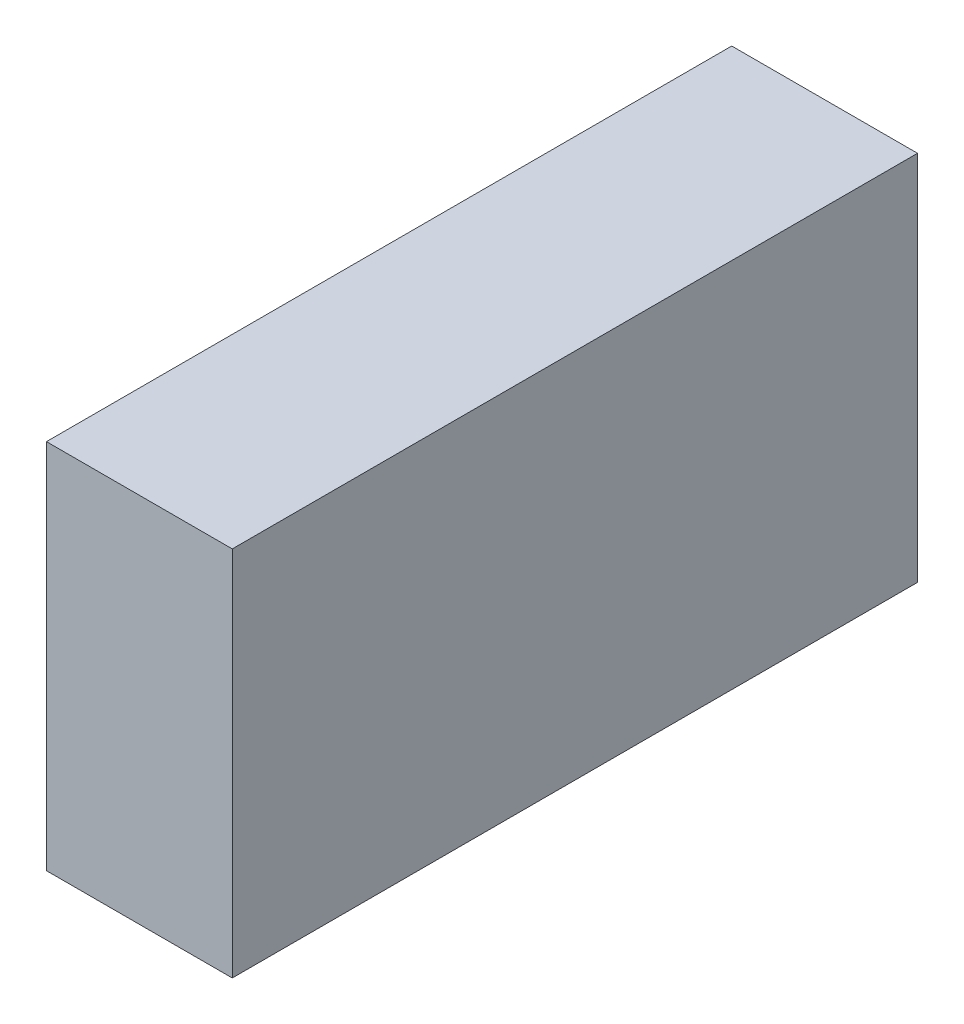
ISO-10303-21;
HEADER;
FILE_DESCRIPTION(('STEP AP214'),'2;1');
FILE_NAME('part.step','',(''),(''),'','','');
FILE_SCHEMA(('AUTOMOTIVE_DESIGN { 1 0 10303 214 1 1 1 1 }'));
ENDSEC;
DATA;
#1=APPLICATION_CONTEXT('core data for automotive mechanical design processes');
#2=APPLICATION_PROTOCOL_DEFINITION('international standard','automotive_design',2000,#1);
#3=PRODUCT_CONTEXT('',#1,'mechanical');
#4=PRODUCT('Part','Part','',(#3));
#5=PRODUCT_RELATED_PRODUCT_CATEGORY('part','',(#4));
#6=PRODUCT_DEFINITION_FORMATION('','',#4);
#7=PRODUCT_DEFINITION_CONTEXT('part definition',#1,'design');
#8=PRODUCT_DEFINITION('design','',#6,#7);
#9=PRODUCT_DEFINITION_SHAPE('','',#8);
#10=(LENGTH_UNIT() NAMED_UNIT(*) SI_UNIT(.MILLI.,.METRE.));
#11=(NAMED_UNIT(*) PLANE_ANGLE_UNIT() SI_UNIT($,.RADIAN.));
#12=(NAMED_UNIT(*) SI_UNIT($,.STERADIAN.) SOLID_ANGLE_UNIT());
#13=UNCERTAINTY_MEASURE_WITH_UNIT(LENGTH_MEASURE(1.E-05),#10,'distance_accuracy_value','');
#14=(GEOMETRIC_REPRESENTATION_CONTEXT(3) GLOBAL_UNCERTAINTY_ASSIGNED_CONTEXT((#13)) GLOBAL_UNIT_ASSIGNED_CONTEXT((#10,
#11,#12)) REPRESENTATION_CONTEXT('',''));
#15=CARTESIAN_POINT('',(0.,0.,0.));
#16=DIRECTION('',(0.,0.,1.));
#17=DIRECTION('',(1.,0.,0.));
#18=AXIS2_PLACEMENT_3D('',#15,#16,#17);
#19=CARTESIAN_POINT('',(0.,25.,0.));
#20=DIRECTION('',(1.,0.,0.));
#21=DIRECTION('',(0.,0.,-1.));
#22=AXIS2_PLACEMENT_3D('',#19,#20,#21);
#23=PLANE('',#22);
#24=DIRECTION('',(0.,0.,-1.));
#25=VECTOR('',#24,1.);
#26=CARTESIAN_POINT('',(0.,10.,0.));
#27=LINE('',#26,#25);
#28=CARTESIAN_POINT('',(0.,10.,0.));
#29=VERTEX_POINT('',#28);
#30=CARTESIAN_POINT('',(0.,10.,-27.66));
#31=VERTEX_POINT('',#30);
#32=EDGE_CURVE('E57',#29,#31,#27,.T.);
#33=ORIENTED_EDGE('',*,*,#32,.F.);
#34=DIRECTION('',(0.,-1.,0.));
#35=VECTOR('',#34,1.);
#36=CARTESIAN_POINT('',(0.,25.,0.));
#37=LINE('',#36,#35);
#38=CARTESIAN_POINT('',(0.,25.,0.));
#39=VERTEX_POINT('',#38);
#40=EDGE_CURVE('E11',#39,#29,#37,.T.);
#41=ORIENTED_EDGE('',*,*,#40,.F.);
#42=DIRECTION('',(0.,0.,1.));
#43=VECTOR('',#42,1.);
#44=CARTESIAN_POINT('',(0.,25.,0.));
#45=LINE('',#44,#43);
#46=CARTESIAN_POINT('',(0.,25.,-27.66));
#47=VERTEX_POINT('',#46);
#48=EDGE_CURVE('E109',#47,#39,#45,.T.);
#49=ORIENTED_EDGE('',*,*,#48,.F.);
#50=DIRECTION('',(0.,-1.,0.));
#51=VECTOR('',#50,1.);
#52=CARTESIAN_POINT('',(0.,25.,-27.66));
#53=LINE('',#52,#51);
#54=EDGE_CURVE('E100',#47,#31,#53,.T.);
#55=ORIENTED_EDGE('',*,*,#54,.T.);
#56=EDGE_LOOP('',(#33,#41,#49,#55));
#57=FACE_BOUND('',#56,.T.);
#58=ADVANCED_FACE('F43',(#57),#23,.F.);
#59=CARTESIAN_POINT('',(0.,25.,0.));
#60=DIRECTION('',(0.,0.,-1.));
#61=DIRECTION('',(-1.,0.,0.));
#62=AXIS2_PLACEMENT_3D('',#59,#60,#61);
#63=PLANE('',#62);
#64=DIRECTION('',(-1.,0.,0.));
#65=VECTOR('',#64,1.);
#66=CARTESIAN_POINT('',(0.,10.,0.));
#67=LINE('',#66,#65);
#68=CARTESIAN_POINT('',(7.5,10.,0.));
#69=VERTEX_POINT('',#68);
#70=EDGE_CURVE('E97',#69,#29,#67,.T.);
#71=ORIENTED_EDGE('',*,*,#70,.F.);
#72=DIRECTION('',(0.,-1.,0.));
#73=VECTOR('',#72,1.);
#74=CARTESIAN_POINT('',(7.5,25.,0.));
#75=LINE('',#74,#73);
#76=CARTESIAN_POINT('',(7.5,25.,0.));
#77=VERTEX_POINT('',#76);
#78=EDGE_CURVE('E50',#77,#69,#75,.T.);
#79=ORIENTED_EDGE('',*,*,#78,.F.);
#80=DIRECTION('',(1.,0.,0.));
#81=VECTOR('',#80,1.);
#82=CARTESIAN_POINT('',(0.,25.,0.));
#83=LINE('',#82,#81);
#84=EDGE_CURVE('E107',#39,#77,#83,.T.);
#85=ORIENTED_EDGE('',*,*,#84,.F.);
#86=ORIENTED_EDGE('',*,*,#40,.T.);
#87=EDGE_LOOP('',(#71,#79,#85,#86));
#88=FACE_BOUND('',#87,.T.);
#89=ADVANCED_FACE('F116',(#88),#63,.F.);
#90=CARTESIAN_POINT('',(7.5,25.,0.));
#91=DIRECTION('',(-1.,0.,0.));
#92=DIRECTION('',(0.,0.,1.));
#93=AXIS2_PLACEMENT_3D('',#90,#91,#92);
#94=PLANE('',#93);
#95=DIRECTION('',(0.,0.,1.));
#96=VECTOR('',#95,1.);
#97=CARTESIAN_POINT('',(7.5,10.,0.));
#98=LINE('',#97,#96);
#99=CARTESIAN_POINT('',(7.5,10.,-27.66));
#100=VERTEX_POINT('',#99);
#101=EDGE_CURVE('E84',#100,#69,#98,.T.);
#102=ORIENTED_EDGE('',*,*,#101,.F.);
#103=DIRECTION('',(0.,-1.,0.));
#104=VECTOR('',#103,1.);
#105=CARTESIAN_POINT('',(7.5,25.,-27.66));
#106=LINE('',#105,#104);
#107=CARTESIAN_POINT('',(7.5,25.,-27.66));
#108=VERTEX_POINT('',#107);
#109=EDGE_CURVE('E95',#108,#100,#106,.T.);
#110=ORIENTED_EDGE('',*,*,#109,.F.);
#111=DIRECTION('',(0.,0.,-1.));
#112=VECTOR('',#111,1.);
#113=CARTESIAN_POINT('',(7.5,25.,0.));
#114=LINE('',#113,#112);
#115=EDGE_CURVE('E105',#77,#108,#114,.T.);
#116=ORIENTED_EDGE('',*,*,#115,.F.);
#117=ORIENTED_EDGE('',*,*,#78,.T.);
#118=EDGE_LOOP('',(#102,#110,#116,#117));
#119=FACE_BOUND('',#118,.T.);
#120=ADVANCED_FACE('F93',(#119),#94,.F.);
#121=CARTESIAN_POINT('',(0.,25.,-27.66));
#122=DIRECTION('',(0.,0.,1.));
#123=DIRECTION('',(1.,0.,0.));
#124=AXIS2_PLACEMENT_3D('',#121,#122,#123);
#125=PLANE('',#124);
#126=DIRECTION('',(1.,0.,0.));
#127=VECTOR('',#126,1.);
#128=CARTESIAN_POINT('',(0.,10.,-27.66));
#129=LINE('',#128,#127);
#130=EDGE_CURVE('E81',#31,#100,#129,.T.);
#131=ORIENTED_EDGE('',*,*,#130,.F.);
#132=ORIENTED_EDGE('',*,*,#54,.F.);
#133=DIRECTION('',(-1.,0.,0.));
#134=VECTOR('',#133,1.);
#135=CARTESIAN_POINT('',(0.,25.,-27.66));
#136=LINE('',#135,#134);
#137=EDGE_CURVE('E65',#108,#47,#136,.T.);
#138=ORIENTED_EDGE('',*,*,#137,.F.);
#139=ORIENTED_EDGE('',*,*,#109,.T.);
#140=EDGE_LOOP('',(#131,#132,#138,#139));
#141=FACE_BOUND('',#140,.T.);
#142=ADVANCED_FACE('F99',(#141),#125,.F.);
#143=CARTESIAN_POINT('',(0.,25.,0.));
#144=DIRECTION('',(0.,-1.,0.));
#145=DIRECTION('',(0.,0.,-1.));
#146=AXIS2_PLACEMENT_3D('',#143,#144,#145);
#147=PLANE('',#146);
#148=ORIENTED_EDGE('',*,*,#48,.T.);
#149=ORIENTED_EDGE('',*,*,#84,.T.);
#150=ORIENTED_EDGE('',*,*,#115,.T.);
#151=ORIENTED_EDGE('',*,*,#137,.T.);
#152=EDGE_LOOP('',(#148,#149,#150,#151));
#153=FACE_BOUND('',#152,.T.);
#154=ADVANCED_FACE('F117',(#153),#147,.F.);
#155=CARTESIAN_POINT('',(0.,10.,0.));
#156=DIRECTION('',(0.,-1.,0.));
#157=DIRECTION('',(0.,0.,-1.));
#158=AXIS2_PLACEMENT_3D('',#155,#156,#157);
#159=PLANE('',#158);
#160=ORIENTED_EDGE('',*,*,#32,.T.);
#161=ORIENTED_EDGE('',*,*,#130,.T.);
#162=ORIENTED_EDGE('',*,*,#101,.T.);
#163=ORIENTED_EDGE('',*,*,#70,.T.);
#164=EDGE_LOOP('',(#160,#161,#162,#163));
#165=FACE_BOUND('',#164,.T.);
#166=ADVANCED_FACE('F83',(#165),#159,.T.);
#167=CLOSED_SHELL('',(#58,#89,#120,#142,#154,#166));
#168=MANIFOLD_SOLID_BREP('B2',#167);
#169=ADVANCED_BREP_SHAPE_REPRESENTATION('',(#18,#168),#14);
#170=SHAPE_DEFINITION_REPRESENTATION(#9,#169);
ENDSEC;
END-ISO-10303-21;
